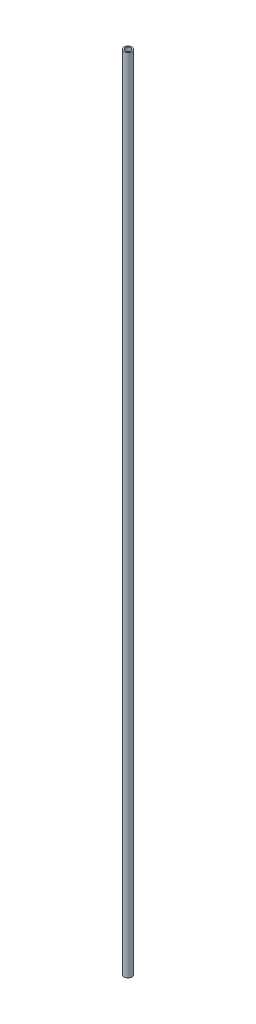
ISO-10303-21;
HEADER;
FILE_DESCRIPTION(('STEP AP214'),'2;1');
FILE_NAME('part.step','',(''),(''),'','','');
FILE_SCHEMA(('AUTOMOTIVE_DESIGN { 1 0 10303 214 1 1 1 1 }'));
ENDSEC;
DATA;
#1=APPLICATION_CONTEXT('core data for automotive mechanical design processes');
#2=APPLICATION_PROTOCOL_DEFINITION('international standard','automotive_design',2000,#1);
#3=PRODUCT_CONTEXT('',#1,'mechanical');
#4=PRODUCT('Part','Part','',(#3));
#5=PRODUCT_RELATED_PRODUCT_CATEGORY('part','',(#4));
#6=PRODUCT_DEFINITION_FORMATION('','',#4);
#7=PRODUCT_DEFINITION_CONTEXT('part definition',#1,'design');
#8=PRODUCT_DEFINITION('design','',#6,#7);
#9=PRODUCT_DEFINITION_SHAPE('','',#8);
#10=(LENGTH_UNIT() NAMED_UNIT(*) SI_UNIT(.MILLI.,.METRE.));
#11=(NAMED_UNIT(*) PLANE_ANGLE_UNIT() SI_UNIT($,.RADIAN.));
#12=(NAMED_UNIT(*) SI_UNIT($,.STERADIAN.) SOLID_ANGLE_UNIT());
#13=UNCERTAINTY_MEASURE_WITH_UNIT(LENGTH_MEASURE(1.E-05),#10,'distance_accuracy_value','');
#14=(GEOMETRIC_REPRESENTATION_CONTEXT(3) GLOBAL_UNCERTAINTY_ASSIGNED_CONTEXT((#13)) GLOBAL_UNIT_ASSIGNED_CONTEXT((#10,
#11,#12)) REPRESENTATION_CONTEXT('',''));
#15=CARTESIAN_POINT('',(0.,0.,0.));
#16=DIRECTION('',(0.,0.,1.));
#17=DIRECTION('',(1.,0.,0.));
#18=AXIS2_PLACEMENT_3D('',#15,#16,#17);
#19=CARTESIAN_POINT('',(0.,37.2593103448276,0.));
#20=DIRECTION('',(0.,1.,0.));
#21=DIRECTION('',(0.,0.,1.));
#22=AXIS2_PLACEMENT_3D('',#19,#20,#21);
#23=CYLINDRICAL_SURFACE('',#22,3.16000000000001);
#24=CARTESIAN_POINT('',(0.,-897.859310344828,0.));
#25=DIRECTION('',(0.,1.,0.));
#26=DIRECTION('',(0.,0.,1.));
#27=AXIS2_PLACEMENT_3D('',#24,#25,#26);
#28=CIRCLE('',#27,3.16000000000001);
#29=CARTESIAN_POINT('',(0.,-897.859310344828,3.16000000000001));
#30=VERTEX_POINT('',#29);
#31=EDGE_CURVE('E53',#30,#30,#28,.T.);
#32=ORIENTED_EDGE('',*,*,#31,.F.);
#33=EDGE_LOOP('',(#32));
#34=FACE_BOUND('',#33,.T.);
#35=CARTESIAN_POINT('',(0.,34.1406896551724,0.));
#36=DIRECTION('',(0.,1.,0.));
#37=DIRECTION('',(0.,0.,1.));
#38=AXIS2_PLACEMENT_3D('',#35,#36,#37);
#39=CIRCLE('',#38,3.16000000000001);
#40=CARTESIAN_POINT('',(0.,34.1406896551724,3.16000000000001));
#41=VERTEX_POINT('',#40);
#42=EDGE_CURVE('E10',#41,#41,#39,.T.);
#43=ORIENTED_EDGE('',*,*,#42,.T.);
#44=EDGE_LOOP('',(#43));
#45=FACE_BOUND('',#44,.T.);
#46=ADVANCED_FACE('F31',(#34,#45),#23,.F.);
#47=CARTESIAN_POINT('',(3.16000000000001,34.1406896551724,0.));
#48=DIRECTION('',(0.,-1.,0.));
#49=DIRECTION('',(0.,0.,-1.));
#50=AXIS2_PLACEMENT_3D('',#47,#48,#49);
#51=PLANE('',#50);
#52=ORIENTED_EDGE('',*,*,#42,.F.);
#53=EDGE_LOOP('',(#52));
#54=FACE_BOUND('',#53,.T.);
#55=CARTESIAN_POINT('',(0.,34.1406896551724,0.));
#56=DIRECTION('',(0.,1.,0.));
#57=DIRECTION('',(0.,0.,1.));
#58=AXIS2_PLACEMENT_3D('',#55,#56,#57);
#59=CIRCLE('',#58,4.76);
#60=CARTESIAN_POINT('',(0.,34.1406896551724,4.76));
#61=VERTEX_POINT('',#60);
#62=EDGE_CURVE('E37',#61,#61,#59,.T.);
#63=ORIENTED_EDGE('',*,*,#62,.T.);
#64=EDGE_LOOP('',(#63));
#65=FACE_BOUND('',#64,.T.);
#66=ADVANCED_FACE('F60',(#54,#65),#51,.F.);
#67=CARTESIAN_POINT('',(0.,37.2593103448276,0.));
#68=DIRECTION('',(0.,1.,0.));
#69=DIRECTION('',(0.,0.,1.));
#70=AXIS2_PLACEMENT_3D('',#67,#68,#69);
#71=CYLINDRICAL_SURFACE('',#70,4.76000000000006);
#72=ORIENTED_EDGE('',*,*,#62,.F.);
#73=EDGE_LOOP('',(#72));
#74=FACE_BOUND('',#73,.T.);
#75=CARTESIAN_POINT('',(0.,-905.859310344828,0.));
#76=DIRECTION('',(0.,1.,0.));
#77=DIRECTION('',(0.,0.,1.));
#78=AXIS2_PLACEMENT_3D('',#75,#76,#77);
#79=CIRCLE('',#78,4.76000000000012);
#80=CARTESIAN_POINT('',(0.,-905.859310344828,4.76000000000012));
#81=VERTEX_POINT('',#80);
#82=EDGE_CURVE('E41',#81,#81,#79,.T.);
#83=ORIENTED_EDGE('',*,*,#82,.T.);
#84=EDGE_LOOP('',(#83));
#85=FACE_BOUND('',#84,.T.);
#86=ADVANCED_FACE('F64',(#74,#85),#71,.T.);
#87=CARTESIAN_POINT('',(4.76000000000012,-905.859310344828,0.));
#88=DIRECTION('',(0.,1.,0.));
#89=DIRECTION('',(0.,0.,1.));
#90=AXIS2_PLACEMENT_3D('',#87,#88,#89);
#91=PLANE('',#90);
#92=ORIENTED_EDGE('',*,*,#82,.F.);
#93=EDGE_LOOP('',(#92));
#94=FACE_BOUND('',#93,.T.);
#95=CARTESIAN_POINT('',(0.,-905.859310344828,0.));
#96=DIRECTION('',(0.,1.,0.));
#97=DIRECTION('',(0.,0.,1.));
#98=AXIS2_PLACEMENT_3D('',#95,#96,#97);
#99=CIRCLE('',#98,3.76000000000011);
#100=CARTESIAN_POINT('',(0.,-905.859310344828,3.76000000000011));
#101=VERTEX_POINT('',#100);
#102=EDGE_CURVE('E45',#101,#101,#99,.T.);
#103=ORIENTED_EDGE('',*,*,#102,.T.);
#104=EDGE_LOOP('',(#103));
#105=FACE_BOUND('',#104,.T.);
#106=ADVANCED_FACE('F69',(#94,#105),#91,.F.);
#107=CARTESIAN_POINT('',(0.,37.2593103448276,0.));
#108=DIRECTION('',(0.,1.,0.));
#109=DIRECTION('',(0.,0.,1.));
#110=AXIS2_PLACEMENT_3D('',#107,#108,#109);
#111=CYLINDRICAL_SURFACE('',#110,3.76000000000011);
#112=ORIENTED_EDGE('',*,*,#102,.F.);
#113=EDGE_LOOP('',(#112));
#114=FACE_BOUND('',#113,.T.);
#115=CARTESIAN_POINT('',(0.,-897.859310344828,0.));
#116=DIRECTION('',(0.,1.,0.));
#117=DIRECTION('',(0.,0.,1.));
#118=AXIS2_PLACEMENT_3D('',#115,#116,#117);
#119=CIRCLE('',#118,3.76000000000011);
#120=CARTESIAN_POINT('',(0.,-897.859310344828,3.76000000000011));
#121=VERTEX_POINT('',#120);
#122=EDGE_CURVE('E50',#121,#121,#119,.T.);
#123=ORIENTED_EDGE('',*,*,#122,.T.);
#124=EDGE_LOOP('',(#123));
#125=FACE_BOUND('',#124,.T.);
#126=ADVANCED_FACE('F75',(#114,#125),#111,.F.);
#127=CARTESIAN_POINT('',(3.76000000000011,-897.859310344828,0.));
#128=DIRECTION('',(0.,1.,0.));
#129=DIRECTION('',(0.,0.,1.));
#130=AXIS2_PLACEMENT_3D('',#127,#128,#129);
#131=PLANE('',#130);
#132=ORIENTED_EDGE('',*,*,#122,.F.);
#133=EDGE_LOOP('',(#132));
#134=FACE_BOUND('',#133,.T.);
#135=ORIENTED_EDGE('',*,*,#31,.T.);
#136=EDGE_LOOP('',(#135));
#137=FACE_BOUND('',#136,.T.);
#138=ADVANCED_FACE('F57',(#134,#137),#131,.F.);
#139=CLOSED_SHELL('',(#46,#66,#86,#106,#126,#138));
#140=MANIFOLD_SOLID_BREP('B2',#139);
#141=ADVANCED_BREP_SHAPE_REPRESENTATION('',(#18,#140),#14);
#142=SHAPE_DEFINITION_REPRESENTATION(#9,#141);
ENDSEC;
END-ISO-10303-21;
